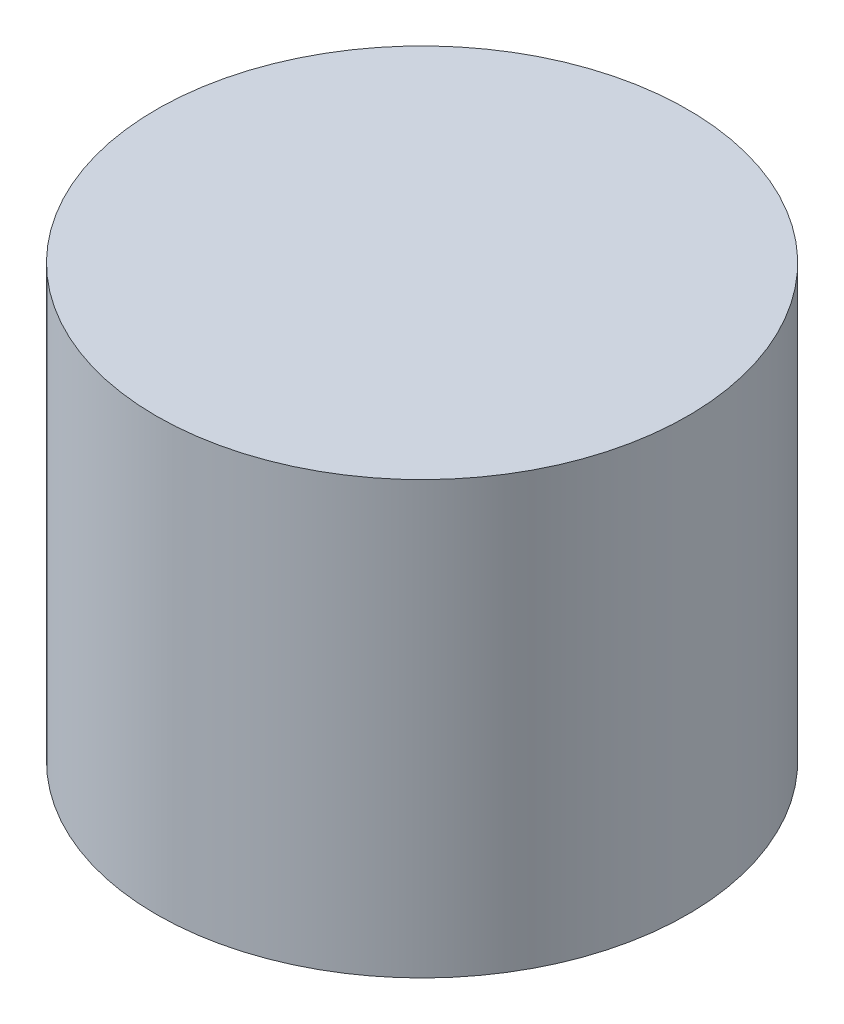
ISO-10303-21;
HEADER;
FILE_DESCRIPTION(('STEP AP214'),'2;1');
FILE_NAME('part.step','',(''),(''),'','','');
FILE_SCHEMA(('AUTOMOTIVE_DESIGN { 1 0 10303 214 1 1 1 1 }'));
ENDSEC;
DATA;
#1=APPLICATION_CONTEXT('core data for automotive mechanical design processes');
#2=APPLICATION_PROTOCOL_DEFINITION('international standard','automotive_design',2000,#1);
#3=PRODUCT_CONTEXT('',#1,'mechanical');
#4=PRODUCT('Part','Part','',(#3));
#5=PRODUCT_RELATED_PRODUCT_CATEGORY('part','',(#4));
#6=PRODUCT_DEFINITION_FORMATION('','',#4);
#7=PRODUCT_DEFINITION_CONTEXT('part definition',#1,'design');
#8=PRODUCT_DEFINITION('design','',#6,#7);
#9=PRODUCT_DEFINITION_SHAPE('','',#8);
#10=(LENGTH_UNIT() NAMED_UNIT(*) SI_UNIT(.MILLI.,.METRE.));
#11=(NAMED_UNIT(*) PLANE_ANGLE_UNIT() SI_UNIT($,.RADIAN.));
#12=(NAMED_UNIT(*) SI_UNIT($,.STERADIAN.) SOLID_ANGLE_UNIT());
#13=UNCERTAINTY_MEASURE_WITH_UNIT(LENGTH_MEASURE(1.E-05),#10,'distance_accuracy_value','');
#14=(GEOMETRIC_REPRESENTATION_CONTEXT(3) GLOBAL_UNCERTAINTY_ASSIGNED_CONTEXT((#13)) GLOBAL_UNIT_ASSIGNED_CONTEXT((#10,
#11,#12)) REPRESENTATION_CONTEXT('',''));
#15=CARTESIAN_POINT('',(0.,0.,0.));
#16=DIRECTION('',(0.,0.,1.));
#17=DIRECTION('',(1.,0.,0.));
#18=AXIS2_PLACEMENT_3D('',#15,#16,#17);
#19=CARTESIAN_POINT('',(0.,82.55,0.));
#20=DIRECTION('',(0.,-1.,0.));
#21=DIRECTION('',(0.,0.,-1.));
#22=AXIS2_PLACEMENT_3D('',#19,#20,#21);
#23=CYLINDRICAL_SURFACE('',#22,50.8);
#24=CARTESIAN_POINT('',(0.,82.55,0.));
#25=DIRECTION('',(0.,1.,0.));
#26=DIRECTION('',(0.,0.,1.));
#27=AXIS2_PLACEMENT_3D('',#24,#25,#26);
#28=CIRCLE('',#27,50.8);
#29=CARTESIAN_POINT('',(0.,82.55,50.8));
#30=VERTEX_POINT('',#29);
#31=EDGE_CURVE('E11',#30,#30,#28,.T.);
#32=ORIENTED_EDGE('',*,*,#31,.F.);
#33=EDGE_LOOP('',(#32));
#34=FACE_BOUND('',#33,.T.);
#35=CARTESIAN_POINT('',(0.,0.,0.));
#36=DIRECTION('',(0.,1.,0.));
#37=DIRECTION('',(0.,0.,1.));
#38=AXIS2_PLACEMENT_3D('',#35,#36,#37);
#39=CIRCLE('',#38,50.8);
#40=CARTESIAN_POINT('',(0.,0.,50.8));
#41=VERTEX_POINT('',#40);
#42=EDGE_CURVE('E39',#41,#41,#39,.T.);
#43=ORIENTED_EDGE('',*,*,#42,.T.);
#44=EDGE_LOOP('',(#43));
#45=FACE_BOUND('',#44,.T.);
#46=ADVANCED_FACE('F36',(#34,#45),#23,.T.);
#47=CARTESIAN_POINT('',(0.,82.55,0.));
#48=DIRECTION('',(0.,1.,0.));
#49=DIRECTION('',(0.,0.,1.));
#50=AXIS2_PLACEMENT_3D('',#47,#48,#49);
#51=PLANE('',#50);
#52=ORIENTED_EDGE('',*,*,#31,.T.);
#53=EDGE_LOOP('',(#52));
#54=FACE_BOUND('',#53,.T.);
#55=ADVANCED_FACE('F88',(#54),#51,.T.);
#56=CARTESIAN_POINT('',(0.,0.,0.));
#57=DIRECTION('',(0.,1.,0.));
#58=DIRECTION('',(0.,0.,1.));
#59=AXIS2_PLACEMENT_3D('',#56,#57,#58);
#60=PLANE('',#59);
#61=CARTESIAN_POINT('',(0.,0.,-44.45));
#62=DIRECTION('',(0.,-1.,0.));
#63=DIRECTION('',(0.,0.,-1.));
#64=AXIS2_PLACEMENT_3D('',#61,#62,#63);
#65=CIRCLE('',#64,1.984375);
#66=CARTESIAN_POINT('',(0.,0.,-46.434375));
#67=VERTEX_POINT('',#66);
#68=EDGE_CURVE('E64',#67,#67,#65,.T.);
#69=ORIENTED_EDGE('',*,*,#68,.F.);
#70=EDGE_LOOP('',(#69));
#71=FACE_BOUND('',#70,.T.);
#72=CARTESIAN_POINT('',(0.,0.,44.45));
#73=DIRECTION('',(0.,-1.,0.));
#74=DIRECTION('',(0.,0.,-1.));
#75=AXIS2_PLACEMENT_3D('',#72,#73,#74);
#76=CIRCLE('',#75,1.984375);
#77=CARTESIAN_POINT('',(0.,0.,42.465625));
#78=VERTEX_POINT('',#77);
#79=EDGE_CURVE('E63',#78,#78,#76,.T.);
#80=ORIENTED_EDGE('',*,*,#79,.F.);
#81=EDGE_LOOP('',(#80));
#82=FACE_BOUND('',#81,.T.);
#83=CARTESIAN_POINT('',(0.,0.,0.));
#84=DIRECTION('',(0.,-1.,0.));
#85=DIRECTION('',(0.,0.,-1.));
#86=AXIS2_PLACEMENT_3D('',#83,#84,#85);
#87=CIRCLE('',#86,2.5527);
#88=CARTESIAN_POINT('',(0.,0.,-2.5527));
#89=VERTEX_POINT('',#88);
#90=EDGE_CURVE('E74',#89,#89,#87,.T.);
#91=ORIENTED_EDGE('',*,*,#90,.F.);
#92=EDGE_LOOP('',(#91));
#93=FACE_BOUND('',#92,.T.);
#94=ORIENTED_EDGE('',*,*,#42,.F.);
#95=EDGE_LOOP('',(#94));
#96=FACE_BOUND('',#95,.T.);
#97=ADVANCED_FACE('F85',(#71,#82,#93,#96),#60,.F.);
#98=CARTESIAN_POINT('',(0.,19.05,0.));
#99=DIRECTION('',(0.,-1.,0.));
#100=DIRECTION('',(0.,0.,-1.));
#101=AXIS2_PLACEMENT_3D('',#98,#99,#100);
#102=CONICAL_SURFACE('',#101,2.5527,1.02974425867665);
#103=CARTESIAN_POINT('',(0.,20.5838169021917,0.));
#104=VERTEX_POINT('',#103);
#105=VERTEX_LOOP('',#104);
#106=FACE_BOUND('',#105,.T.);
#107=CARTESIAN_POINT('',(0.,19.05,0.));
#108=DIRECTION('',(0.,-1.,0.));
#109=DIRECTION('',(0.,0.,-1.));
#110=AXIS2_PLACEMENT_3D('',#107,#108,#109);
#111=CIRCLE('',#110,2.5527);
#112=CARTESIAN_POINT('',(0.,19.05,-2.5527));
#113=VERTEX_POINT('',#112);
#114=EDGE_CURVE('E77',#113,#113,#111,.T.);
#115=ORIENTED_EDGE('',*,*,#114,.T.);
#116=EDGE_LOOP('',(#115));
#117=FACE_BOUND('',#116,.T.);
#118=ADVANCED_FACE('F87',(#106,#117),#102,.F.);
#119=CARTESIAN_POINT('',(0.,0.,0.));
#120=DIRECTION('',(0.,-1.,0.));
#121=DIRECTION('',(0.,0.,-1.));
#122=AXIS2_PLACEMENT_3D('',#119,#120,#121);
#123=CYLINDRICAL_SURFACE('',#122,2.5527);
#124=ORIENTED_EDGE('',*,*,#114,.F.);
#125=EDGE_LOOP('',(#124));
#126=FACE_BOUND('',#125,.T.);
#127=ORIENTED_EDGE('',*,*,#90,.T.);
#128=EDGE_LOOP('',(#127));
#129=FACE_BOUND('',#128,.T.);
#130=ADVANCED_FACE('F94',(#126,#129),#123,.F.);
#131=CARTESIAN_POINT('',(0.,5.08,44.45));
#132=DIRECTION('',(0.,-1.,0.));
#133=DIRECTION('',(0.,0.,-1.));
#134=AXIS2_PLACEMENT_3D('',#131,#132,#133);
#135=CONICAL_SURFACE('',#134,1.984375,1.02974425867665);
#136=CARTESIAN_POINT('',(0.,6.27233279088282,44.45));
#137=VERTEX_POINT('',#136);
#138=VERTEX_LOOP('',#137);
#139=FACE_BOUND('',#138,.T.);
#140=CARTESIAN_POINT('',(0.,5.08,44.45));
#141=DIRECTION('',(0.,-1.,0.));
#142=DIRECTION('',(0.,0.,-1.));
#143=AXIS2_PLACEMENT_3D('',#140,#141,#142);
#144=CIRCLE('',#143,1.984375);
#145=CARTESIAN_POINT('',(0.,5.08,42.465625));
#146=VERTEX_POINT('',#145);
#147=EDGE_CURVE('E67',#146,#146,#144,.T.);
#148=ORIENTED_EDGE('',*,*,#147,.T.);
#149=EDGE_LOOP('',(#148));
#150=FACE_BOUND('',#149,.T.);
#151=ADVANCED_FACE('F125',(#139,#150),#135,.F.);
#152=CARTESIAN_POINT('',(0.,0.,44.45));
#153=DIRECTION('',(0.,-1.,0.));
#154=DIRECTION('',(0.,0.,-1.));
#155=AXIS2_PLACEMENT_3D('',#152,#153,#154);
#156=CYLINDRICAL_SURFACE('',#155,1.984375);
#157=ORIENTED_EDGE('',*,*,#147,.F.);
#158=EDGE_LOOP('',(#157));
#159=FACE_BOUND('',#158,.T.);
#160=ORIENTED_EDGE('',*,*,#79,.T.);
#161=EDGE_LOOP('',(#160));
#162=FACE_BOUND('',#161,.T.);
#163=ADVANCED_FACE('F57',(#159,#162),#156,.F.);
#164=CARTESIAN_POINT('',(0.,5.08,-44.45));
#165=DIRECTION('',(0.,-1.,0.));
#166=DIRECTION('',(0.,0.,-1.));
#167=AXIS2_PLACEMENT_3D('',#164,#165,#166);
#168=CONICAL_SURFACE('',#167,1.984375,1.02974425867665);
#169=CARTESIAN_POINT('',(0.,6.27233279088282,-44.45));
#170=VERTEX_POINT('',#169);
#171=VERTEX_LOOP('',#170);
#172=FACE_BOUND('',#171,.T.);
#173=CARTESIAN_POINT('',(0.,5.08,-44.45));
#174=DIRECTION('',(0.,-1.,0.));
#175=DIRECTION('',(0.,0.,-1.));
#176=AXIS2_PLACEMENT_3D('',#173,#174,#175);
#177=CIRCLE('',#176,1.984375);
#178=CARTESIAN_POINT('',(0.,5.08,-46.434375));
#179=VERTEX_POINT('',#178);
#180=EDGE_CURVE('E61',#179,#179,#177,.T.);
#181=ORIENTED_EDGE('',*,*,#180,.T.);
#182=EDGE_LOOP('',(#181));
#183=FACE_BOUND('',#182,.T.);
#184=ADVANCED_FACE('F53',(#172,#183),#168,.F.);
#185=CARTESIAN_POINT('',(0.,0.,-44.45));
#186=DIRECTION('',(0.,-1.,0.));
#187=DIRECTION('',(0.,0.,-1.));
#188=AXIS2_PLACEMENT_3D('',#185,#186,#187);
#189=CYLINDRICAL_SURFACE('',#188,1.984375);
#190=ORIENTED_EDGE('',*,*,#180,.F.);
#191=EDGE_LOOP('',(#190));
#192=FACE_BOUND('',#191,.T.);
#193=ORIENTED_EDGE('',*,*,#68,.T.);
#194=EDGE_LOOP('',(#193));
#195=FACE_BOUND('',#194,.T.);
#196=ADVANCED_FACE('F56',(#192,#195),#189,.F.);
#197=CLOSED_SHELL('',(#46,#55,#97,#118,#130,#151,#163,#184,#196));
#198=MANIFOLD_SOLID_BREP('B2',#197);
#199=ADVANCED_BREP_SHAPE_REPRESENTATION('',(#18,#198),#14);
#200=SHAPE_DEFINITION_REPRESENTATION(#9,#199);
ENDSEC;
END-ISO-10303-21;
